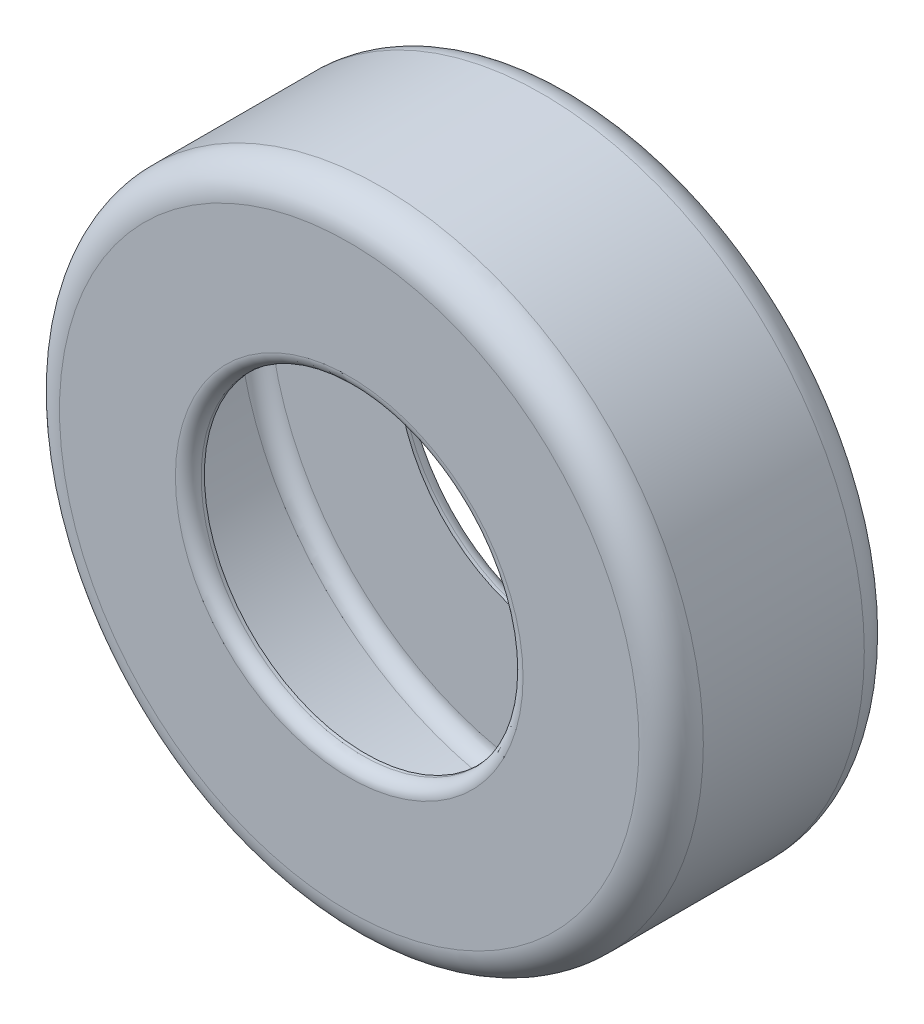
ISO-10303-21;
HEADER;
FILE_DESCRIPTION(('STEP AP214'),'2;1');
FILE_NAME('part.step','',(''),(''),'','','');
FILE_SCHEMA(('AUTOMOTIVE_DESIGN { 1 0 10303 214 1 1 1 1 }'));
ENDSEC;
DATA;
#1=APPLICATION_CONTEXT('core data for automotive mechanical design processes');
#2=APPLICATION_PROTOCOL_DEFINITION('international standard','automotive_design',2000,#1);
#3=PRODUCT_CONTEXT('',#1,'mechanical');
#4=PRODUCT('Part','Part','',(#3));
#5=PRODUCT_RELATED_PRODUCT_CATEGORY('part','',(#4));
#6=PRODUCT_DEFINITION_FORMATION('','',#4);
#7=PRODUCT_DEFINITION_CONTEXT('part definition',#1,'design');
#8=PRODUCT_DEFINITION('design','',#6,#7);
#9=PRODUCT_DEFINITION_SHAPE('','',#8);
#10=(LENGTH_UNIT() NAMED_UNIT(*) SI_UNIT(.MILLI.,.METRE.));
#11=(NAMED_UNIT(*) PLANE_ANGLE_UNIT() SI_UNIT($,.RADIAN.));
#12=(NAMED_UNIT(*) SI_UNIT($,.STERADIAN.) SOLID_ANGLE_UNIT());
#13=UNCERTAINTY_MEASURE_WITH_UNIT(LENGTH_MEASURE(1.E-05),#10,'distance_accuracy_value','');
#14=(GEOMETRIC_REPRESENTATION_CONTEXT(3) GLOBAL_UNCERTAINTY_ASSIGNED_CONTEXT((#13)) GLOBAL_UNIT_ASSIGNED_CONTEXT((#10,
#11,#12)) REPRESENTATION_CONTEXT('',''));
#15=CARTESIAN_POINT('',(0.,0.,0.));
#16=DIRECTION('',(0.,0.,1.));
#17=DIRECTION('',(1.,0.,0.));
#18=AXIS2_PLACEMENT_3D('',#15,#16,#17);
#19=CARTESIAN_POINT('',(0.,0.,17.78));
#20=DIRECTION('',(0.,0.,-1.));
#21=DIRECTION('',(-1.,0.,0.));
#22=AXIS2_PLACEMENT_3D('',#19,#20,#21);
#23=CYLINDRICAL_SURFACE('',#22,12.7);
#24=CARTESIAN_POINT('',(0.,0.,16.764));
#25=DIRECTION('',(0.,0.,1.));
#26=DIRECTION('',(1.,0.,0.));
#27=AXIS2_PLACEMENT_3D('',#24,#25,#26);
#28=CIRCLE('',#27,12.7);
#29=CARTESIAN_POINT('',(12.7,0.,16.764));
#30=VERTEX_POINT('',#29);
#31=EDGE_CURVE('E48',#30,#30,#28,.T.);
#32=ORIENTED_EDGE('',*,*,#31,.T.);
#33=EDGE_LOOP('',(#32));
#34=FACE_BOUND('',#33,.T.);
#35=CARTESIAN_POINT('',(0.,0.,16.51));
#36=DIRECTION('',(0.,0.,1.));
#37=DIRECTION('',(1.,0.,0.));
#38=AXIS2_PLACEMENT_3D('',#35,#36,#37);
#39=CIRCLE('',#38,12.7);
#40=CARTESIAN_POINT('',(12.7,0.,16.51));
#41=VERTEX_POINT('',#40);
#42=EDGE_CURVE('E72',#41,#41,#39,.F.);
#43=ORIENTED_EDGE('',*,*,#42,.T.);
#44=EDGE_LOOP('',(#43));
#45=FACE_BOUND('',#44,.T.);
#46=ADVANCED_FACE('F37',(#34,#45),#23,.F.);
#47=CARTESIAN_POINT('',(0.,0.,17.78));
#48=DIRECTION('',(0.,0.,1.));
#49=DIRECTION('',(1.,0.,0.));
#50=AXIS2_PLACEMENT_3D('',#47,#48,#49);
#51=PLANE('',#50);
#52=CARTESIAN_POINT('',(0.,0.,17.78));
#53=DIRECTION('',(0.,0.,1.));
#54=DIRECTION('',(1.,0.,0.));
#55=AXIS2_PLACEMENT_3D('',#52,#53,#54);
#56=CIRCLE('',#55,13.716);
#57=CARTESIAN_POINT('',(13.716,0.,17.78));
#58=VERTEX_POINT('',#57);
#59=EDGE_CURVE('E11',#58,#58,#56,.F.);
#60=ORIENTED_EDGE('',*,*,#59,.T.);
#61=EDGE_LOOP('',(#60));
#62=FACE_BOUND('',#61,.T.);
#63=CARTESIAN_POINT('',(0.,0.,17.78));
#64=DIRECTION('',(0.,0.,1.));
#65=DIRECTION('',(1.,0.,0.));
#66=AXIS2_PLACEMENT_3D('',#63,#64,#65);
#67=CIRCLE('',#66,22.86);
#68=CARTESIAN_POINT('',(22.86,0.,17.78));
#69=VERTEX_POINT('',#68);
#70=EDGE_CURVE('E57',#69,#69,#67,.T.);
#71=ORIENTED_EDGE('',*,*,#70,.T.);
#72=EDGE_LOOP('',(#71));
#73=FACE_BOUND('',#72,.T.);
#74=ADVANCED_FACE('F98',(#62,#73),#51,.T.);
#75=CARTESIAN_POINT('',(0.,0.,0.));
#76=DIRECTION('',(0.,0.,1.));
#77=DIRECTION('',(1.,0.,0.));
#78=AXIS2_PLACEMENT_3D('',#75,#76,#77);
#79=PLANE('',#78);
#80=CARTESIAN_POINT('',(0.,0.,0.));
#81=DIRECTION('',(0.,0.,1.));
#82=DIRECTION('',(1.,0.,0.));
#83=AXIS2_PLACEMENT_3D('',#80,#81,#82);
#84=CIRCLE('',#83,13.716);
#85=CARTESIAN_POINT('',(13.716,0.,0.));
#86=VERTEX_POINT('',#85);
#87=EDGE_CURVE('E52',#86,#86,#84,.T.);
#88=ORIENTED_EDGE('',*,*,#87,.T.);
#89=EDGE_LOOP('',(#88));
#90=FACE_BOUND('',#89,.T.);
#91=CARTESIAN_POINT('',(0.,0.,0.));
#92=DIRECTION('',(0.,0.,1.));
#93=DIRECTION('',(1.,0.,0.));
#94=AXIS2_PLACEMENT_3D('',#91,#92,#93);
#95=CIRCLE('',#94,22.86);
#96=CARTESIAN_POINT('',(22.86,0.,0.));
#97=VERTEX_POINT('',#96);
#98=EDGE_CURVE('E60',#97,#97,#95,.F.);
#99=ORIENTED_EDGE('',*,*,#98,.T.);
#100=EDGE_LOOP('',(#99));
#101=FACE_BOUND('',#100,.T.);
#102=ADVANCED_FACE('F105',(#90,#101),#79,.F.);
#103=CARTESIAN_POINT('',(0.,0.,17.78));
#104=DIRECTION('',(0.,0.,-1.));
#105=DIRECTION('',(-1.,0.,0.));
#106=AXIS2_PLACEMENT_3D('',#103,#104,#105);
#107=CYLINDRICAL_SURFACE('',#106,25.4);
#108=CARTESIAN_POINT('',(0.,0.,2.54));
#109=DIRECTION('',(0.,0.,1.));
#110=DIRECTION('',(1.,0.,0.));
#111=AXIS2_PLACEMENT_3D('',#108,#109,#110);
#112=CIRCLE('',#111,25.4);
#113=CARTESIAN_POINT('',(25.4,0.,2.54));
#114=VERTEX_POINT('',#113);
#115=EDGE_CURVE('E63',#114,#114,#112,.T.);
#116=ORIENTED_EDGE('',*,*,#115,.T.);
#117=EDGE_LOOP('',(#116));
#118=FACE_BOUND('',#117,.T.);
#119=CARTESIAN_POINT('',(0.,0.,15.24));
#120=DIRECTION('',(0.,0.,1.));
#121=DIRECTION('',(1.,0.,0.));
#122=AXIS2_PLACEMENT_3D('',#119,#120,#121);
#123=CIRCLE('',#122,25.4);
#124=CARTESIAN_POINT('',(25.4,0.,15.24));
#125=VERTEX_POINT('',#124);
#126=EDGE_CURVE('E66',#125,#125,#123,.F.);
#127=ORIENTED_EDGE('',*,*,#126,.T.);
#128=EDGE_LOOP('',(#127));
#129=FACE_BOUND('',#128,.T.);
#130=ADVANCED_FACE('F110',(#118,#129),#107,.T.);
#131=CARTESIAN_POINT('',(0.,0.,1.27));
#132=DIRECTION('',(0.,0.,1.));
#133=DIRECTION('',(1.,0.,0.));
#134=AXIS2_PLACEMENT_3D('',#131,#132,#133);
#135=CIRCLE('',#134,12.7);
#136=CARTESIAN_POINT('',(12.7,0.,1.27));
#137=VERTEX_POINT('',#136);
#138=EDGE_CURVE('E69',#137,#137,#135,.F.);
#139=ORIENTED_EDGE('',*,*,#138,.F.);
#140=EDGE_LOOP('',(#139));
#141=FACE_BOUND('',#140,.T.);
#142=CARTESIAN_POINT('',(0.,0.,1.016));
#143=DIRECTION('',(0.,0.,1.));
#144=DIRECTION('',(1.,0.,0.));
#145=AXIS2_PLACEMENT_3D('',#142,#143,#144);
#146=CIRCLE('',#145,12.7);
#147=CARTESIAN_POINT('',(12.7,0.,1.016));
#148=VERTEX_POINT('',#147);
#149=EDGE_CURVE('E44',#148,#148,#146,.F.);
#150=ORIENTED_EDGE('',*,*,#149,.T.);
#151=EDGE_LOOP('',(#150));
#152=FACE_BOUND('',#151,.T.);
#153=ADVANCED_FACE('F101',(#141,#152),#23,.F.);
#154=CARTESIAN_POINT('',(0.,0.,2.54));
#155=DIRECTION('',(0.,0.,1.));
#156=DIRECTION('',(1.,0.,0.));
#157=AXIS2_PLACEMENT_3D('',#154,#155,#156);
#158=TOROIDAL_SURFACE('',#157,22.86,2.54);
#159=ORIENTED_EDGE('',*,*,#98,.F.);
#160=EDGE_LOOP('',(#159));
#161=FACE_BOUND('',#160,.T.);
#162=ORIENTED_EDGE('',*,*,#115,.F.);
#163=EDGE_LOOP('',(#162));
#164=FACE_BOUND('',#163,.T.);
#165=ADVANCED_FACE('F109',(#161,#164),#158,.T.);
#166=CARTESIAN_POINT('',(0.,0.,15.24));
#167=DIRECTION('',(0.,0.,1.));
#168=DIRECTION('',(1.,0.,0.));
#169=AXIS2_PLACEMENT_3D('',#166,#167,#168);
#170=TOROIDAL_SURFACE('',#169,22.86,2.54);
#171=ORIENTED_EDGE('',*,*,#126,.F.);
#172=EDGE_LOOP('',(#171));
#173=FACE_BOUND('',#172,.T.);
#174=ORIENTED_EDGE('',*,*,#70,.F.);
#175=EDGE_LOOP('',(#174));
#176=FACE_BOUND('',#175,.T.);
#177=ADVANCED_FACE('F116',(#173,#176),#170,.T.);
#178=CARTESIAN_POINT('',(0.,0.,1.016));
#179=DIRECTION('',(0.,0.,1.));
#180=DIRECTION('',(1.,0.,0.));
#181=AXIS2_PLACEMENT_3D('',#178,#179,#180);
#182=TOROIDAL_SURFACE('',#181,13.716,1.016);
#183=ORIENTED_EDGE('',*,*,#149,.F.);
#184=EDGE_LOOP('',(#183));
#185=FACE_BOUND('',#184,.T.);
#186=ORIENTED_EDGE('',*,*,#87,.F.);
#187=EDGE_LOOP('',(#186));
#188=FACE_BOUND('',#187,.T.);
#189=ADVANCED_FACE('F180',(#185,#188),#182,.T.);
#190=CARTESIAN_POINT('',(0.,0.,16.764));
#191=DIRECTION('',(0.,0.,1.));
#192=DIRECTION('',(1.,0.,0.));
#193=AXIS2_PLACEMENT_3D('',#190,#191,#192);
#194=TOROIDAL_SURFACE('',#193,13.716,1.016);
#195=ORIENTED_EDGE('',*,*,#59,.F.);
#196=EDGE_LOOP('',(#195));
#197=FACE_BOUND('',#196,.T.);
#198=ORIENTED_EDGE('',*,*,#31,.F.);
#199=EDGE_LOOP('',(#198));
#200=FACE_BOUND('',#199,.T.);
#201=ADVANCED_FACE('F39',(#197,#200),#194,.T.);
#202=CARTESIAN_POINT('',(0.,0.,16.51));
#203=DIRECTION('',(0.,0.,1.));
#204=DIRECTION('',(1.,0.,0.));
#205=AXIS2_PLACEMENT_3D('',#202,#203,#204);
#206=PLANE('',#205);
#207=CARTESIAN_POINT('',(0.,0.,16.51));
#208=DIRECTION('',(0.,0.,1.));
#209=DIRECTION('',(1.,0.,0.));
#210=AXIS2_PLACEMENT_3D('',#207,#208,#209);
#211=CIRCLE('',#210,22.86);
#212=CARTESIAN_POINT('',(22.86,0.,16.51));
#213=VERTEX_POINT('',#212);
#214=EDGE_CURVE('E75',#213,#213,#211,.T.);
#215=ORIENTED_EDGE('',*,*,#214,.F.);
#216=EDGE_LOOP('',(#215));
#217=FACE_BOUND('',#216,.T.);
#218=ORIENTED_EDGE('',*,*,#42,.F.);
#219=EDGE_LOOP('',(#218));
#220=FACE_BOUND('',#219,.T.);
#221=ADVANCED_FACE('F90',(#217,#220),#206,.F.);
#222=CARTESIAN_POINT('',(0.,0.,1.27));
#223=DIRECTION('',(0.,0.,1.));
#224=DIRECTION('',(1.,0.,0.));
#225=AXIS2_PLACEMENT_3D('',#222,#223,#224);
#226=PLANE('',#225);
#227=CARTESIAN_POINT('',(0.,0.,1.27));
#228=DIRECTION('',(0.,0.,1.));
#229=DIRECTION('',(1.,0.,0.));
#230=AXIS2_PLACEMENT_3D('',#227,#228,#229);
#231=CIRCLE('',#230,22.86);
#232=CARTESIAN_POINT('',(22.86,0.,1.27));
#233=VERTEX_POINT('',#232);
#234=EDGE_CURVE('E76',#233,#233,#231,.F.);
#235=ORIENTED_EDGE('',*,*,#234,.F.);
#236=EDGE_LOOP('',(#235));
#237=FACE_BOUND('',#236,.T.);
#238=ORIENTED_EDGE('',*,*,#138,.T.);
#239=EDGE_LOOP('',(#238));
#240=FACE_BOUND('',#239,.T.);
#241=ADVANCED_FACE('F93',(#237,#240),#226,.T.);
#242=CARTESIAN_POINT('',(0.,0.,17.78));
#243=DIRECTION('',(0.,0.,-1.));
#244=DIRECTION('',(-1.,0.,0.));
#245=AXIS2_PLACEMENT_3D('',#242,#243,#244);
#246=CYLINDRICAL_SURFACE('',#245,24.13);
#247=CARTESIAN_POINT('',(0.,0.,2.54));
#248=DIRECTION('',(0.,0.,-1.));
#249=DIRECTION('',(-1.,0.,0.));
#250=AXIS2_PLACEMENT_3D('',#247,#248,#249);
#251=CIRCLE('',#250,24.13);
#252=CARTESIAN_POINT('',(-24.13,0.,2.54));
#253=VERTEX_POINT('',#252);
#254=EDGE_CURVE('E79',#253,#253,#251,.F.);
#255=ORIENTED_EDGE('',*,*,#254,.F.);
#256=EDGE_LOOP('',(#255));
#257=FACE_BOUND('',#256,.T.);
#258=CARTESIAN_POINT('',(0.,0.,15.24));
#259=DIRECTION('',(0.,0.,-1.));
#260=DIRECTION('',(-1.,0.,0.));
#261=AXIS2_PLACEMENT_3D('',#258,#259,#260);
#262=CIRCLE('',#261,24.13);
#263=CARTESIAN_POINT('',(-24.13,0.,15.24));
#264=VERTEX_POINT('',#263);
#265=EDGE_CURVE('E82',#264,#264,#262,.T.);
#266=ORIENTED_EDGE('',*,*,#265,.F.);
#267=EDGE_LOOP('',(#266));
#268=FACE_BOUND('',#267,.T.);
#269=ADVANCED_FACE('F124',(#257,#268),#246,.F.);
#270=CARTESIAN_POINT('',(0.,0.,2.54));
#271=DIRECTION('',(0.,0.,1.));
#272=DIRECTION('',(1.,0.,0.));
#273=AXIS2_PLACEMENT_3D('',#270,#271,#272);
#274=TOROIDAL_SURFACE('',#273,22.86,1.27);
#275=ORIENTED_EDGE('',*,*,#234,.T.);
#276=EDGE_LOOP('',(#275));
#277=FACE_BOUND('',#276,.T.);
#278=ORIENTED_EDGE('',*,*,#254,.T.);
#279=EDGE_LOOP('',(#278));
#280=FACE_BOUND('',#279,.T.);
#281=ADVANCED_FACE('F130',(#277,#280),#274,.F.);
#282=CARTESIAN_POINT('',(0.,0.,15.24));
#283=DIRECTION('',(0.,0.,1.));
#284=DIRECTION('',(1.,0.,0.));
#285=AXIS2_PLACEMENT_3D('',#282,#283,#284);
#286=TOROIDAL_SURFACE('',#285,22.86,1.27);
#287=ORIENTED_EDGE('',*,*,#265,.T.);
#288=EDGE_LOOP('',(#287));
#289=FACE_BOUND('',#288,.T.);
#290=ORIENTED_EDGE('',*,*,#214,.T.);
#291=EDGE_LOOP('',(#290));
#292=FACE_BOUND('',#291,.T.);
#293=ADVANCED_FACE('F88',(#289,#292),#286,.F.);
#294=CLOSED_SHELL('',(#46,#74,#102,#130,#153,#165,#177,#189,#201,#221,#241,#269,#281,#293));
#295=MANIFOLD_SOLID_BREP('B2',#294);
#296=ADVANCED_BREP_SHAPE_REPRESENTATION('',(#18,#295),#14);
#297=SHAPE_DEFINITION_REPRESENTATION(#9,#296);
ENDSEC;
END-ISO-10303-21;
